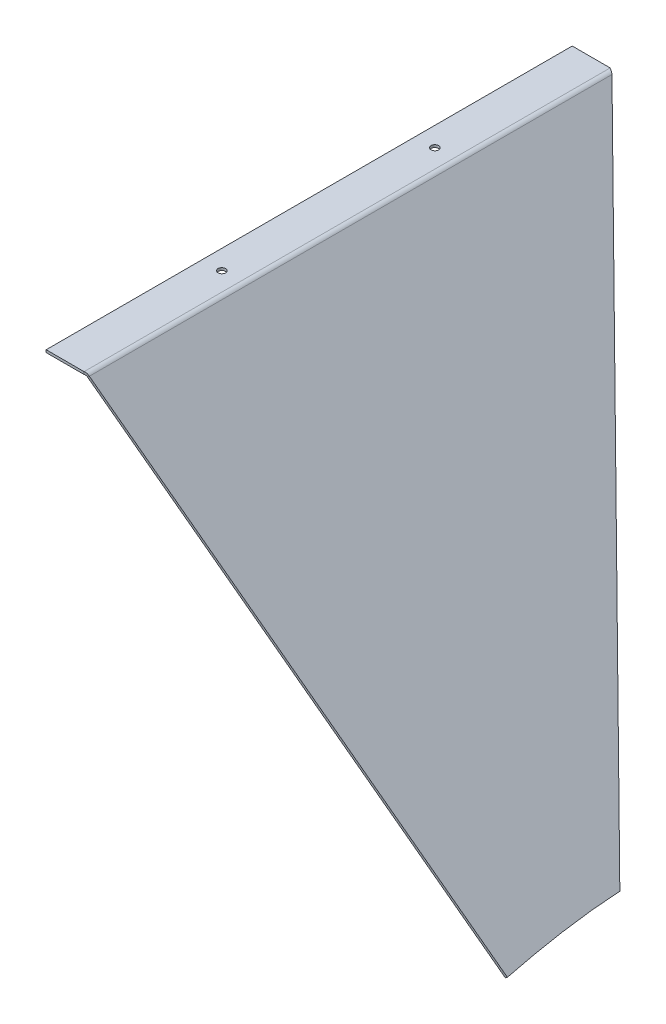
ISO-10303-21;
HEADER;
FILE_DESCRIPTION(('STEP AP214'),'2;1');
FILE_NAME('part.step','',(''),(''),'','','');
FILE_SCHEMA(('AUTOMOTIVE_DESIGN { 1 0 10303 214 1 1 1 1 }'));
ENDSEC;
DATA;
#1=APPLICATION_CONTEXT('core data for automotive mechanical design processes');
#2=APPLICATION_PROTOCOL_DEFINITION('international standard','automotive_design',2000,#1);
#3=PRODUCT_CONTEXT('',#1,'mechanical');
#4=PRODUCT('Part','Part','',(#3));
#5=PRODUCT_RELATED_PRODUCT_CATEGORY('part','',(#4));
#6=PRODUCT_DEFINITION_FORMATION('','',#4);
#7=PRODUCT_DEFINITION_CONTEXT('part definition',#1,'design');
#8=PRODUCT_DEFINITION('design','',#6,#7);
#9=PRODUCT_DEFINITION_SHAPE('','',#8);
#10=(LENGTH_UNIT() NAMED_UNIT(*) SI_UNIT(.MILLI.,.METRE.));
#11=(NAMED_UNIT(*) PLANE_ANGLE_UNIT() SI_UNIT($,.RADIAN.));
#12=(NAMED_UNIT(*) SI_UNIT($,.STERADIAN.) SOLID_ANGLE_UNIT());
#13=UNCERTAINTY_MEASURE_WITH_UNIT(LENGTH_MEASURE(1.E-05),#10,'distance_accuracy_value','');
#14=(GEOMETRIC_REPRESENTATION_CONTEXT(3) GLOBAL_UNCERTAINTY_ASSIGNED_CONTEXT((#13)) GLOBAL_UNIT_ASSIGNED_CONTEXT((#10,
#11,#12)) REPRESENTATION_CONTEXT('',''));
#15=CARTESIAN_POINT('',(0.,0.,0.));
#16=DIRECTION('',(0.,0.,1.));
#17=DIRECTION('',(1.,0.,0.));
#18=AXIS2_PLACEMENT_3D('',#15,#16,#17);
#19=CARTESIAN_POINT('',(-212.983750394162,3.33066907387547E-13,-210.16475123244));
#20=DIRECTION('',(0.,0.,-1.));
#21=DIRECTION('',(1.,0.,0.));
#22=AXIS2_PLACEMENT_3D('',#19,#20,#21);
#23=PLANE('',#22);
#24=DIRECTION('',(0.,1.,0.));
#25=VECTOR('',#24,1.);
#26=CARTESIAN_POINT('',(-212.983750394162,3.33066907387547E-13,-210.16475123244));
#27=LINE('',#26,#25);
#28=CARTESIAN_POINT('',(-212.983750394162,-2.00000000000103,-210.16475123244));
#29=VERTEX_POINT('',#28);
#30=CARTESIAN_POINT('',(-212.983750394162,3.33066907387547E-13,-210.16475123244));
#31=VERTEX_POINT('',#30);
#32=EDGE_CURVE('E11',#29,#31,#27,.T.);
#33=ORIENTED_EDGE('',*,*,#32,.F.);
#34=DIRECTION('',(1.,0.,0.));
#35=VECTOR('',#34,1.);
#36=CARTESIAN_POINT('',(200.024756253983,-2.00000000000101,-210.16475123244));
#37=LINE('',#36,#35);
#38=CARTESIAN_POINT('',(-242.983750394162,-2.00000000000103,-210.16475123244));
#39=VERTEX_POINT('',#38);
#40=EDGE_CURVE('E142',#39,#29,#37,.T.);
#41=ORIENTED_EDGE('',*,*,#40,.F.);
#42=DIRECTION('',(0.,1.,0.));
#43=VECTOR('',#42,1.);
#44=CARTESIAN_POINT('',(-242.983750394162,4.44089209850063E-13,-210.16475123244));
#45=LINE('',#44,#43);
#46=CARTESIAN_POINT('',(-242.983750394162,4.44089209850063E-13,-210.16475123244));
#47=VERTEX_POINT('',#46);
#48=EDGE_CURVE('E55',#39,#47,#45,.T.);
#49=ORIENTED_EDGE('',*,*,#48,.T.);
#50=DIRECTION('',(1.,0.,0.));
#51=VECTOR('',#50,1.);
#52=CARTESIAN_POINT('',(-212.983750394162,3.33066907387547E-13,-210.16475123244));
#53=LINE('',#52,#51);
#54=EDGE_CURVE('E292',#47,#31,#53,.T.);
#55=ORIENTED_EDGE('',*,*,#54,.T.);
#56=EDGE_LOOP('',(#33,#41,#49,#55));
#57=FACE_BOUND('',#56,.T.);
#58=ADVANCED_FACE('F43',(#57),#23,.T.);
#59=CARTESIAN_POINT('',(-242.983750394162,4.44089209850063E-13,-210.16475123244));
#60=DIRECTION('',(-1.,0.,0.));
#61=DIRECTION('',(0.,0.,-1.));
#62=AXIS2_PLACEMENT_3D('',#59,#60,#61);
#63=PLANE('',#62);
#64=ORIENTED_EDGE('',*,*,#48,.F.);
#65=DIRECTION('',(0.,0.,1.));
#66=VECTOR('',#65,1.);
#67=CARTESIAN_POINT('',(-242.983750394162,-2.00000000000102,105.521367319601));
#68=LINE('',#67,#66);
#69=CARTESIAN_POINT('',(-242.983750394162,-2.00000000000102,209.716839146918));
#70=VERTEX_POINT('',#69);
#71=EDGE_CURVE('E646',#70,#39,#68,.F.);
#72=ORIENTED_EDGE('',*,*,#71,.F.);
#73=DIRECTION('',(0.,1.,0.));
#74=VECTOR('',#73,1.);
#75=CARTESIAN_POINT('',(-242.983750394162,4.44089209850063E-13,209.716839146918));
#76=LINE('',#75,#74);
#77=CARTESIAN_POINT('',(-242.983750394162,4.44089209850063E-13,209.716839146918));
#78=VERTEX_POINT('',#77);
#79=EDGE_CURVE('E642',#70,#78,#76,.T.);
#80=ORIENTED_EDGE('',*,*,#79,.T.);
#81=DIRECTION('',(0.,0.,-1.));
#82=VECTOR('',#81,1.);
#83=CARTESIAN_POINT('',(-242.983750394162,4.44089209850063E-13,-210.16475123244));
#84=LINE('',#83,#82);
#85=EDGE_CURVE('E297',#78,#47,#84,.T.);
#86=ORIENTED_EDGE('',*,*,#85,.T.);
#87=EDGE_LOOP('',(#64,#72,#80,#86));
#88=FACE_BOUND('',#87,.T.);
#89=ADVANCED_FACE('F337',(#88),#63,.T.);
#90=CARTESIAN_POINT('',(-212.983750394162,4.44089209850063E-13,209.716839146918));
#91=DIRECTION('',(0.,0.,1.));
#92=DIRECTION('',(-1.,0.,0.));
#93=AXIS2_PLACEMENT_3D('',#90,#91,#92);
#94=PLANE('',#93);
#95=ORIENTED_EDGE('',*,*,#79,.F.);
#96=DIRECTION('',(1.,0.,0.));
#97=VECTOR('',#96,1.);
#98=CARTESIAN_POINT('',(200.024756253983,-2.000000000001,209.716839146918));
#99=LINE('',#98,#97);
#100=CARTESIAN_POINT('',(-212.983750394162,-2.00000000000102,209.716839146918));
#101=VERTEX_POINT('',#100);
#102=EDGE_CURVE('E375',#101,#70,#99,.F.);
#103=ORIENTED_EDGE('',*,*,#102,.F.);
#104=DIRECTION('',(0.,1.,0.));
#105=VECTOR('',#104,1.);
#106=CARTESIAN_POINT('',(-212.983750394162,4.44089209850063E-13,209.716839146918));
#107=LINE('',#106,#105);
#108=CARTESIAN_POINT('',(-212.983750394162,4.44089209850063E-13,209.716839146918));
#109=VERTEX_POINT('',#108);
#110=EDGE_CURVE('E422',#101,#109,#107,.T.);
#111=ORIENTED_EDGE('',*,*,#110,.T.);
#112=DIRECTION('',(-1.,0.,0.));
#113=VECTOR('',#112,1.);
#114=CARTESIAN_POINT('',(-212.983750394162,4.44089209850063E-13,209.716839146918));
#115=LINE('',#114,#113);
#116=EDGE_CURVE('E301',#109,#78,#115,.T.);
#117=ORIENTED_EDGE('',*,*,#116,.T.);
#118=EDGE_LOOP('',(#95,#103,#111,#117));
#119=FACE_BOUND('',#118,.T.);
#120=ADVANCED_FACE('F343',(#119),#94,.T.);
#121=CARTESIAN_POINT('',(-212.983750394162,4.44089209850063E-13,209.716839146918));
#122=DIRECTION('',(0.173873809013477,0.,0.984767941465981));
#123=DIRECTION('',(-0.98476794146598,0.,0.173873809013477));
#124=AXIS2_PLACEMENT_3D('',#121,#122,#123);
#125=PLANE('',#124);
#126=ORIENTED_EDGE('',*,*,#110,.F.);
#127=DIRECTION('',(-0.98476794146598,0.,0.173873809013477));
#128=VECTOR('',#127,1.);
#129=CARTESIAN_POINT('',(-212.983750394162,-1.99999999999956,209.716839146918));
#130=LINE('',#129,#128);
#131=CARTESIAN_POINT('',(-212.694087450412,-2.00000000000102,209.665695321821));
#132=VERTEX_POINT('',#131);
#133=EDGE_CURVE('E138',#132,#101,#130,.T.);
#134=ORIENTED_EDGE('',*,*,#133,.F.);
#135=CARTESIAN_POINT('',(-212.694087450413,-8.30065183254902E-13,209.665695321821));
#136=CARTESIAN_POINT('',(-212.694087450413,-2.00000000000083,209.665695321821));
#137=B_SPLINE_CURVE_WITH_KNOTS('',1,(#135,#136),.UNSPECIFIED.,.F.,.F.,(2,2),(0.,1.),.UNSPECIFIED.);
#138=CARTESIAN_POINT('',(-212.694087450412,4.44089209850063E-13,209.665695321821));
#139=VERTEX_POINT('',#138);
#140=EDGE_CURVE('E257',#132,#139,#137,.F.);
#141=ORIENTED_EDGE('',*,*,#140,.T.);
#142=DIRECTION('',(-0.98476794146598,0.,0.173873809013477));
#143=VECTOR('',#142,1.);
#144=CARTESIAN_POINT('',(-212.983750394162,4.44089209850063E-13,209.716839146918));
#145=LINE('',#144,#143);
#146=EDGE_CURVE('E272',#139,#109,#145,.T.);
#147=ORIENTED_EDGE('',*,*,#146,.T.);
#148=EDGE_LOOP('',(#126,#134,#141,#147));
#149=FACE_BOUND('',#148,.T.);
#150=ADVANCED_FACE('F225',(#149),#125,.T.);
#151=CARTESIAN_POINT('',(-209.119216027711,-1.70512620117162,209.099911779111));
#152=CARTESIAN_POINT('',(-209.548804236997,-1.17462894304268,209.194236490375));
#153=CARTESIAN_POINT('',(-210.097790781909,-0.741898683723455,209.288506293348));
#154=CARTESIAN_POINT('',(-211.32968202828,-0.154316700259513,209.477100807584));
#155=CARTESIAN_POINT('',(-212.011465028835,-8.30067048991432E-13,209.571370610557));
#156=CARTESIAN_POINT('',(-212.694087450413,-8.30065183254902E-13,209.665695321821));
#157=CARTESIAN_POINT('',(-210.673507950624,-2.96376698327128,209.099911779111));
#158=CARTESIAN_POINT('',(-210.916315965262,-2.66392405641098,209.194235436708));
#159=CARTESIAN_POINT('',(-211.226615420389,-2.41933403862666,209.288506293348));
#160=CARTESIAN_POINT('',(-211.922901777033,-2.08722248275574,209.477100807584));
#161=CARTESIAN_POINT('',(-212.30826169601,-2.00000000000083,209.571371664224));
#162=CARTESIAN_POINT('',(-212.694087450413,-2.00000000000083,209.665695321821));
#163=B_SPLINE_SURFACE_WITH_KNOTS('',1,3,((#151,#152,#153,#154,#155,#156),(#157,#158,#159,#160,
#161,#162)),.UNSPECIFIED.,.F.,.F.,.F.,(2,2),(4,2,4),(0.,1.),(0.,0.5,1.),.UNSPECIFIED.);
#164=CARTESIAN_POINT('',(-212.694087450413,-2.00000000000083,209.665695321821));
#165=CARTESIAN_POINT('',(-212.30826169601,-2.00000000000083,209.571371664224));
#166=CARTESIAN_POINT('',(-211.922901777033,-2.08722248275574,209.477100807584));
#167=CARTESIAN_POINT('',(-211.226615420389,-2.41933403862666,209.288506293348));
#168=CARTESIAN_POINT('',(-210.916315965262,-2.66392405641098,209.194235436708));
#169=CARTESIAN_POINT('',(-210.673507950624,-2.96376698327128,209.099911779111));
#170=B_SPLINE_CURVE_WITH_KNOTS('',3,(#164,#165,#166,#167,#168,#169),.UNSPECIFIED.,.F.,.F.,(4,2,
4),(0.,0.5,1.),.UNSPECIFIED.);
#171=CARTESIAN_POINT('',(-210.673507950625,-2.96376698327128,209.099911779111));
#172=VERTEX_POINT('',#171);
#173=EDGE_CURVE('E132',#172,#132,#170,.F.);
#174=CARTESIAN_POINT('',(-210.673507950624,-2.96376698327128,209.099911779111));
#175=CARTESIAN_POINT('',(-209.119216027711,-1.70512620117162,209.099911779111));
#176=B_SPLINE_CURVE_WITH_KNOTS('',1,(#174,#175),.UNSPECIFIED.,.F.,.F.,(2,2),(0.,1.),.UNSPECIFIED.);
#177=CARTESIAN_POINT('',(-209.11921602771,-1.70512620117114,209.099911779111));
#178=VERTEX_POINT('',#177);
#179=EDGE_CURVE('E201',#172,#178,#176,.T.);
#180=CARTESIAN_POINT('',(-209.119216027711,-1.70512620117162,209.099911779111));
#181=CARTESIAN_POINT('',(-209.548804236997,-1.17462894304268,209.194236490375));
#182=CARTESIAN_POINT('',(-210.097790781909,-0.741898683723455,209.288506293348));
#183=CARTESIAN_POINT('',(-211.32968202828,-0.154316700259513,209.477100807584));
#184=CARTESIAN_POINT('',(-212.011465028835,-8.30067048991432E-13,209.571370610557));
#185=CARTESIAN_POINT('',(-212.694087450413,-8.30065183254902E-13,209.665695321821));
#186=B_SPLINE_CURVE_WITH_KNOTS('',3,(#180,#181,#182,#183,#184,#185),.UNSPECIFIED.,.F.,.F.,(4,2,
4),(0.,0.5,1.),.UNSPECIFIED.);
#187=EDGE_CURVE('E120',#178,#139,#186,.T.);
#188=ORIENTED_EDGE('',*,*,#140,.F.);
#189=ORIENTED_EDGE('',*,*,#173,.F.);
#190=ORIENTED_EDGE('',*,*,#179,.T.);
#191=ORIENTED_EDGE('',*,*,#187,.T.);
#192=EDGE_LOOP('',(#188,#189,#190,#191));
#193=FACE_BOUND('',#192,.T.);
#194=ADVANCED_FACE('F212',(#193),#163,.F.);
#195=CARTESIAN_POINT('',(-211.318116508365,1.01028974989403,209.716839146918));
#196=DIRECTION('',(0.109422333481686,-0.135125328477965,0.984767941465981));
#197=DIRECTION('',(-0.61973454601671,0.765308428682585,0.173873809013477));
#198=AXIS2_PLACEMENT_3D('',#195,#196,#197);
#199=PLANE('',#198);
#200=ORIENTED_EDGE('',*,*,#179,.F.);
#201=DIRECTION('',(-0.61973454601671,0.765308428682585,0.173873809013477));
#202=VECTOR('',#201,1.);
#203=CARTESIAN_POINT('',(-212.872408431279,-0.248351032205649,209.716839146918));
#204=LINE('',#203,#202);
#205=CARTESIAN_POINT('',(49.8711120542214,-324.709577377762,136.001057133384));
#206=VERTEX_POINT('',#205);
#207=EDGE_CURVE('E374',#206,#172,#204,.T.);
#208=ORIENTED_EDGE('',*,*,#207,.F.);
#209=DIRECTION('',(0.777145961456972,0.629320391049836,0.));
#210=VECTOR('',#209,1.);
#211=CARTESIAN_POINT('',(51.4254039771354,-323.450936595663,136.001057133384));
#212=LINE('',#211,#210);
#213=CARTESIAN_POINT('',(51.4254039771354,-323.450936595663,136.001057133384));
#214=VERTEX_POINT('',#213);
#215=EDGE_CURVE('E198',#206,#214,#212,.T.);
#216=ORIENTED_EDGE('',*,*,#215,.T.);
#217=DIRECTION('',(-0.61973454601671,0.765308428682585,0.173873809013477));
#218=VECTOR('',#217,1.);
#219=CARTESIAN_POINT('',(-211.318116508365,1.01028974989403,209.716839146918));
#220=LINE('',#219,#218);
#221=EDGE_CURVE('E309',#214,#178,#220,.T.);
#222=ORIENTED_EDGE('',*,*,#221,.T.);
#223=EDGE_LOOP('',(#200,#208,#216,#222));
#224=FACE_BOUND('',#223,.T.);
#225=ADVANCED_FACE('F224',(#224),#199,.T.);
#226=CARTESIAN_POINT('',(44.8159523652646,-315.288943593907,35.9112998267714));
#227=CARTESIAN_POINT('',(45.5254815552095,-316.165139173049,76.932008688372));
#228=CARTESIAN_POINT('',(49.9041243624014,-321.572312725133,129.596807563132));
#229=CARTESIAN_POINT('',(57.4760581931329,-330.922872282175,188.182667124129));
#230=(BOUNDED_CURVE() B_SPLINE_CURVE(3,(#226,#227,#228,#229),.UNSPECIFIED.,.F.,
.F.) B_SPLINE_CURVE_WITH_KNOTS((4,4),(0.,1.),
.UNSPECIFIED.) CURVE() GEOMETRIC_REPRESENTATION_ITEM() RATIONAL_B_SPLINE_CURVE((1.,
0.963777010772526,0.963777010772526,1.)) REPRESENTATION_ITEM(''));
#231=DIRECTION('',(-0.777145961456972,-0.629320391049836,0.));
#232=VECTOR('',#231,1.);
#233=SURFACE_OF_LINEAR_EXTRUSION('',#230,#232);
#234=ORIENTED_EDGE('',*,*,#215,.F.);
#235=CARTESIAN_POINT('',(43.2616604423507,-316.547584376007,35.9112998267714));
#236=CARTESIAN_POINT('',(43.9711896322956,-317.423779955149,76.932008688372));
#237=CARTESIAN_POINT('',(48.3498324394875,-322.830953507232,129.596807563132));
#238=CARTESIAN_POINT('',(55.9217662702189,-332.181513064274,188.182667124129));
#239=(BOUNDED_CURVE() B_SPLINE_CURVE(3,(#235,#236,#237,#238),.UNSPECIFIED.,.F.,
.F.) B_SPLINE_CURVE_WITH_KNOTS((4,4),(0.,1.),
.UNSPECIFIED.) CURVE() GEOMETRIC_REPRESENTATION_ITEM() RATIONAL_B_SPLINE_CURVE((1.,
0.963777010772526,0.963777010772526,1.)) REPRESENTATION_ITEM(''));
#240=CARTESIAN_POINT('',(43.3373713851553,-316.641079603995,39.7071694117073));
#241=VERTEX_POINT('',#240);
#242=EDGE_CURVE('E381',#241,#206,#239,.T.);
#243=ORIENTED_EDGE('',*,*,#242,.F.);
#244=DIRECTION('',(0.777145961456972,0.629320391049836,0.));
#245=VECTOR('',#244,1.);
#246=CARTESIAN_POINT('',(44.8916633080693,-315.382438821895,39.7071694117073));
#247=LINE('',#246,#245);
#248=CARTESIAN_POINT('',(44.8916633080693,-315.382438821895,39.7071694117073));
#249=VERTEX_POINT('',#248);
#250=EDGE_CURVE('E191',#241,#249,#247,.T.);
#251=ORIENTED_EDGE('',*,*,#250,.T.);
#252=EDGE_CURVE('E314',#249,#214,#230,.T.);
#253=ORIENTED_EDGE('',*,*,#252,.T.);
#254=EDGE_LOOP('',(#234,#243,#251,#253));
#255=FACE_BOUND('',#254,.T.);
#256=ADVANCED_FACE('F328',(#255),#233,.T.);
#257=CARTESIAN_POINT('',(44.8916633080693,-315.382438821895,39.7071694117073));
#258=DIRECTION('',(0.32919017698519,-0.406516013518283,-0.852278451053212));
#259=DIRECTION('',(0.536356208100153,-0.662344756272809,0.523088369083406));
#260=AXIS2_PLACEMENT_3D('',#257,#258,#259);
#261=PLANE('',#260);
#262=ORIENTED_EDGE('',*,*,#250,.F.);
#263=DIRECTION('',(0.536356208100153,-0.662344756272809,0.523088369083406));
#264=VECTOR('',#263,1.);
#265=CARTESIAN_POINT('',(43.3373713851553,-316.641079603995,39.7071694117073));
#266=LINE('',#265,#264);
#267=CARTESIAN_POINT('',(-210.673507950624,-2.96376698327127,-208.020244934513));
#268=VERTEX_POINT('',#267);
#269=EDGE_CURVE('E150',#268,#241,#266,.T.);
#270=ORIENTED_EDGE('',*,*,#269,.F.);
#271=CARTESIAN_POINT('',(-209.119216027711,-1.70512620117162,-208.020244934513));
#272=CARTESIAN_POINT('',(-210.673507950624,-2.96376698327128,-208.020244934513));
#273=B_SPLINE_CURVE_WITH_KNOTS('',1,(#271,#272),.UNSPECIFIED.,.F.,.F.,(2,2),(0.,1.),.UNSPECIFIED.);
#274=CARTESIAN_POINT('',(-209.11921602771,-1.70512620117114,-208.020244934513));
#275=VERTEX_POINT('',#274);
#276=EDGE_CURVE('E64',#268,#275,#273,.F.);
#277=ORIENTED_EDGE('',*,*,#276,.T.);
#278=DIRECTION('',(0.536356208100153,-0.662344756272809,0.523088369083406));
#279=VECTOR('',#278,1.);
#280=CARTESIAN_POINT('',(44.8916633080693,-315.382438821895,39.7071694117073));
#281=LINE('',#280,#279);
#282=EDGE_CURVE('E323',#275,#249,#281,.T.);
#283=ORIENTED_EDGE('',*,*,#282,.T.);
#284=EDGE_LOOP('',(#262,#270,#277,#283));
#285=FACE_BOUND('',#284,.T.);
#286=ADVANCED_FACE('F174',(#285),#261,.T.);
#287=CARTESIAN_POINT('',(-212.694087450413,-8.37871438896798E-13,-209.986969761322));
#288=CARTESIAN_POINT('',(-212.011499192579,-8.37864953719286E-13,-209.659103266421));
#289=CARTESIAN_POINT('',(-211.32968202828,-0.154316700259519,-209.331394819052));
#290=CARTESIAN_POINT('',(-210.097790781909,-0.741898683723459,-208.675819876783));
#291=CARTESIAN_POINT('',(-209.548782737056,-1.17465549325855,-208.348111429415));
#292=CARTESIAN_POINT('',(-209.119216027711,-1.70512620117162,-208.020244934513));
#293=CARTESIAN_POINT('',(-212.694087450413,-2.00000000000084,-209.986969761322));
#294=CARTESIAN_POINT('',(-212.308303232797,-2.00000000000084,-209.659125817714));
#295=CARTESIAN_POINT('',(-211.922901777033,-2.08722248275574,-209.331394819052));
#296=CARTESIAN_POINT('',(-211.226615420389,-2.41933403862667,-208.675819876783));
#297=CARTESIAN_POINT('',(-210.916289825315,-2.66395633655722,-208.348088878122));
#298=CARTESIAN_POINT('',(-210.673507950624,-2.96376698327128,-208.020244934513));
#299=B_SPLINE_SURFACE_WITH_KNOTS('',1,3,((#287,#288,#289,#290,#291,#292),(#293,#294,#295,#296,
#297,#298)),.UNSPECIFIED.,.F.,.F.,.F.,(2,2),(4,2,4),(0.,1.),(0.,0.5,1.),.UNSPECIFIED.);
#300=CARTESIAN_POINT('',(-210.673507950624,-2.96376698327128,-208.020244934513));
#301=CARTESIAN_POINT('',(-210.916289825315,-2.66395633655722,-208.348088878122));
#302=CARTESIAN_POINT('',(-211.226615420389,-2.41933403862667,-208.675819876783));
#303=CARTESIAN_POINT('',(-211.922901777033,-2.08722248275574,-209.331394819052));
#304=CARTESIAN_POINT('',(-212.308303232797,-2.00000000000084,-209.659125817714));
#305=CARTESIAN_POINT('',(-212.694087450413,-2.00000000000084,-209.986969761322));
#306=B_SPLINE_CURVE_WITH_KNOTS('',3,(#300,#301,#302,#303,#304,#305),.UNSPECIFIED.,.F.,.F.,(4,2,
4),(0.,0.5,1.),.UNSPECIFIED.);
#307=CARTESIAN_POINT('',(-212.694087450412,-2.00000000000103,-209.986969761322));
#308=VERTEX_POINT('',#307);
#309=EDGE_CURVE('E129',#308,#268,#306,.F.);
#310=CARTESIAN_POINT('',(-212.694087450413,-2.00000000000084,-209.986969761322));
#311=CARTESIAN_POINT('',(-212.694087450413,-8.37871438896798E-13,-209.986969761322));
#312=B_SPLINE_CURVE_WITH_KNOTS('',1,(#310,#311),.UNSPECIFIED.,.F.,.F.,(2,2),(0.,1.),.UNSPECIFIED.);
#313=CARTESIAN_POINT('',(-212.694087450412,4.44089209850063E-13,-209.986969761322));
#314=VERTEX_POINT('',#313);
#315=EDGE_CURVE('E106',#308,#314,#312,.T.);
#316=CARTESIAN_POINT('',(-212.694087450413,-8.37871438896798E-13,-209.986969761322));
#317=CARTESIAN_POINT('',(-212.011499192579,-8.37864953719286E-13,-209.659103266421));
#318=CARTESIAN_POINT('',(-211.32968202828,-0.154316700259519,-209.331394819052));
#319=CARTESIAN_POINT('',(-210.097790781909,-0.741898683723459,-208.675819876783));
#320=CARTESIAN_POINT('',(-209.548782737056,-1.17465549325855,-208.348111429415));
#321=CARTESIAN_POINT('',(-209.119216027711,-1.70512620117162,-208.020244934513));
#322=B_SPLINE_CURVE_WITH_KNOTS('',3,(#316,#317,#318,#319,#320,#321),.UNSPECIFIED.,.F.,.F.,(4,2,
4),(0.,0.5,1.),.UNSPECIFIED.);
#323=EDGE_CURVE('E394',#314,#275,#322,.T.);
#324=ORIENTED_EDGE('',*,*,#276,.F.);
#325=ORIENTED_EDGE('',*,*,#309,.F.);
#326=ORIENTED_EDGE('',*,*,#315,.T.);
#327=ORIENTED_EDGE('',*,*,#323,.T.);
#328=EDGE_LOOP('',(#324,#325,#326,#327));
#329=FACE_BOUND('',#328,.T.);
#330=ADVANCED_FACE('F146',(#329),#299,.F.);
#331=CARTESIAN_POINT('',(-227.5,0.,-85.));
#332=DIRECTION('',(0.,-1.,0.));
#333=DIRECTION('',(1.,0.,0.));
#334=AXIS2_PLACEMENT_3D('',#331,#332,#333);
#335=CYLINDRICAL_SURFACE('',#334,2.99999999999999);
#336=CARTESIAN_POINT('',(-227.5,0.,-85.));
#337=DIRECTION('',(0.,1.,0.));
#338=DIRECTION('',(0.,0.,1.));
#339=AXIS2_PLACEMENT_3D('',#336,#337,#338);
#340=CIRCLE('',#339,2.99999999999999);
#341=CARTESIAN_POINT('',(-227.5,0.,-82.));
#342=VERTEX_POINT('',#341);
#343=EDGE_CURVE('E260',#342,#342,#340,.T.);
#344=ORIENTED_EDGE('',*,*,#343,.T.);
#345=EDGE_LOOP('',(#344));
#346=FACE_BOUND('',#345,.T.);
#347=CARTESIAN_POINT('',(-227.5,-2.,-85.));
#348=DIRECTION('',(0.,1.,0.));
#349=DIRECTION('',(0.,0.,1.));
#350=AXIS2_PLACEMENT_3D('',#347,#348,#349);
#351=CIRCLE('',#350,2.99999999999999);
#352=CARTESIAN_POINT('',(-227.5,-2.,-82.));
#353=VERTEX_POINT('',#352);
#354=EDGE_CURVE('E357',#353,#353,#351,.T.);
#355=ORIENTED_EDGE('',*,*,#354,.F.);
#356=EDGE_LOOP('',(#355));
#357=FACE_BOUND('',#356,.T.);
#358=ADVANCED_FACE('F173',(#346,#357),#335,.F.);
#359=CARTESIAN_POINT('',(-227.5,0.,85.));
#360=DIRECTION('',(0.,-1.,0.));
#361=DIRECTION('',(1.,0.,0.));
#362=AXIS2_PLACEMENT_3D('',#359,#360,#361);
#363=CYLINDRICAL_SURFACE('',#362,2.99999999999999);
#364=CARTESIAN_POINT('',(-227.5,0.,85.));
#365=DIRECTION('',(0.,1.,0.));
#366=DIRECTION('',(0.,0.,1.));
#367=AXIS2_PLACEMENT_3D('',#364,#365,#366);
#368=CIRCLE('',#367,2.99999999999999);
#369=CARTESIAN_POINT('',(-227.5,0.,88.));
#370=VERTEX_POINT('',#369);
#371=EDGE_CURVE('E265',#370,#370,#368,.T.);
#372=ORIENTED_EDGE('',*,*,#371,.T.);
#373=EDGE_LOOP('',(#372));
#374=FACE_BOUND('',#373,.T.);
#375=CARTESIAN_POINT('',(-227.5,-2.,85.));
#376=DIRECTION('',(0.,1.,0.));
#377=DIRECTION('',(0.,0.,1.));
#378=AXIS2_PLACEMENT_3D('',#375,#376,#377);
#379=CIRCLE('',#378,2.99999999999999);
#380=CARTESIAN_POINT('',(-227.5,-2.,88.));
#381=VERTEX_POINT('',#380);
#382=EDGE_CURVE('E360',#381,#381,#379,.T.);
#383=ORIENTED_EDGE('',*,*,#382,.F.);
#384=EDGE_LOOP('',(#383));
#385=FACE_BOUND('',#384,.T.);
#386=ADVANCED_FACE('F45',(#374,#385),#363,.F.);
#387=CARTESIAN_POINT('',(194.137619674627,-1.11022302462516E-12,39.7071694117073));
#388=DIRECTION('',(0.523088369083407,0.,-0.852278451053212));
#389=DIRECTION('',(0.852278451053212,0.,0.523088369083406));
#390=AXIS2_PLACEMENT_3D('',#387,#388,#389);
#391=PLANE('',#390);
#392=DIRECTION('',(0.852278451053212,0.,0.523088369083406));
#393=VECTOR('',#392,1.);
#394=CARTESIAN_POINT('',(194.137619674627,-2.00000000000111,39.7071694117073));
#395=LINE('',#394,#393);
#396=EDGE_CURVE('E110',#29,#308,#395,.T.);
#397=ORIENTED_EDGE('',*,*,#396,.F.);
#398=ORIENTED_EDGE('',*,*,#32,.T.);
#399=DIRECTION('',(0.852278451053212,0.,0.523088369083406));
#400=VECTOR('',#399,1.);
#401=CARTESIAN_POINT('',(194.137619674627,-1.11022302462516E-12,39.7071694117073));
#402=LINE('',#401,#400);
#403=EDGE_CURVE('E113',#31,#314,#402,.T.);
#404=ORIENTED_EDGE('',*,*,#403,.T.);
#405=ORIENTED_EDGE('',*,*,#315,.F.);
#406=EDGE_LOOP('',(#397,#398,#404,#405));
#407=FACE_BOUND('',#406,.T.);
#408=ADVANCED_FACE('F108',(#407),#391,.T.);
#409=CARTESIAN_POINT('',(-212.694087450413,-4.60000000000083,420.224435532473));
#410=DIRECTION('',(0.,0.,-1.));
#411=DIRECTION('',(0.,1.,0.));
#412=AXIS2_PLACEMENT_3D('',#409,#410,#411);
#413=CYLINDRICAL_SURFACE('',#412,4.6);
#414=ORIENTED_EDGE('',*,*,#323,.F.);
#415=DIRECTION('',(0.,0.,-1.));
#416=VECTOR('',#415,1.);
#417=CARTESIAN_POINT('',(-212.694087450412,-1.11022302462516E-12,105.521367319601));
#418=LINE('',#417,#416);
#419=EDGE_CURVE('E283',#139,#314,#418,.T.);
#420=ORIENTED_EDGE('',*,*,#419,.F.);
#421=ORIENTED_EDGE('',*,*,#187,.F.);
#422=DIRECTION('',(0.,0.,-1.));
#423=VECTOR('',#422,1.);
#424=CARTESIAN_POINT('',(-209.119216027711,-1.70512620117158,105.521367319601));
#425=LINE('',#424,#423);
#426=EDGE_CURVE('E305',#178,#275,#425,.T.);
#427=ORIENTED_EDGE('',*,*,#426,.T.);
#428=EDGE_LOOP('',(#414,#420,#421,#427));
#429=FACE_BOUND('',#428,.T.);
#430=ADVANCED_FACE('F348',(#429),#413,.T.);
#431=CARTESIAN_POINT('',(48.5965584023535,-319.957603239088,105.521367319601));
#432=DIRECTION('',(-0.777145961456972,-0.629320391049836,0.));
#433=DIRECTION('',(0.629320391049836,-0.777145961456972,0.));
#434=AXIS2_PLACEMENT_3D('',#431,#432,#433);
#435=PLANE('',#434);
#436=ORIENTED_EDGE('',*,*,#426,.F.);
#437=ORIENTED_EDGE('',*,*,#221,.F.);
#438=ORIENTED_EDGE('',*,*,#252,.F.);
#439=ORIENTED_EDGE('',*,*,#282,.F.);
#440=EDGE_LOOP('',(#436,#437,#438,#439));
#441=FACE_BOUND('',#440,.T.);
#442=ADVANCED_FACE('F403',(#441),#435,.F.);
#443=CARTESIAN_POINT('',(200.024756253983,-9.99200722162641E-13,105.521367319601));
#444=DIRECTION('',(0.,-1.,0.));
#445=DIRECTION('',(1.,0.,0.));
#446=AXIS2_PLACEMENT_3D('',#443,#444,#445);
#447=PLANE('',#446);
#448=ORIENTED_EDGE('',*,*,#343,.F.);
#449=EDGE_LOOP('',(#448));
#450=FACE_BOUND('',#449,.T.);
#451=ORIENTED_EDGE('',*,*,#371,.F.);
#452=EDGE_LOOP('',(#451));
#453=FACE_BOUND('',#452,.T.);
#454=ORIENTED_EDGE('',*,*,#146,.F.);
#455=ORIENTED_EDGE('',*,*,#419,.T.);
#456=ORIENTED_EDGE('',*,*,#403,.F.);
#457=ORIENTED_EDGE('',*,*,#54,.F.);
#458=ORIENTED_EDGE('',*,*,#85,.F.);
#459=ORIENTED_EDGE('',*,*,#116,.F.);
#460=EDGE_LOOP('',(#454,#455,#456,#457,#458,#459));
#461=FACE_BOUND('',#460,.T.);
#462=ADVANCED_FACE('F426',(#450,#453,#461),#447,.F.);
#463=CARTESIAN_POINT('',(-212.694087450413,-4.60000000000083,420.224435532473));
#464=DIRECTION('',(0.,0.,-1.));
#465=DIRECTION('',(0.,1.,0.));
#466=AXIS2_PLACEMENT_3D('',#463,#464,#465);
#467=CYLINDRICAL_SURFACE('',#466,2.6);
#468=ORIENTED_EDGE('',*,*,#309,.T.);
#469=DIRECTION('',(0.,0.,-1.));
#470=VECTOR('',#469,1.);
#471=CARTESIAN_POINT('',(-210.673507950624,-2.96376698327125,420.224435532473));
#472=LINE('',#471,#470);
#473=EDGE_CURVE('E371',#172,#268,#472,.T.);
#474=ORIENTED_EDGE('',*,*,#473,.F.);
#475=ORIENTED_EDGE('',*,*,#173,.T.);
#476=DIRECTION('',(0.,0.,1.));
#477=VECTOR('',#476,1.);
#478=CARTESIAN_POINT('',(-212.694087450412,-2.00000000000102,105.521367319601));
#479=LINE('',#478,#477);
#480=EDGE_CURVE('E126',#132,#308,#479,.F.);
#481=ORIENTED_EDGE('',*,*,#480,.T.);
#482=EDGE_LOOP('',(#468,#474,#475,#481));
#483=FACE_BOUND('',#482,.T.);
#484=ADVANCED_FACE('F127',(#483),#467,.F.);
#485=CARTESIAN_POINT('',(47.0422664794395,-321.216244021187,105.521367319601));
#486=DIRECTION('',(-0.777145961456972,-0.629320391049836,0.));
#487=DIRECTION('',(0.629320391049836,-0.777145961456972,0.));
#488=AXIS2_PLACEMENT_3D('',#485,#486,#487);
#489=PLANE('',#488);
#490=ORIENTED_EDGE('',*,*,#473,.T.);
#491=ORIENTED_EDGE('',*,*,#269,.T.);
#492=ORIENTED_EDGE('',*,*,#242,.T.);
#493=ORIENTED_EDGE('',*,*,#207,.T.);
#494=EDGE_LOOP('',(#490,#491,#492,#493));
#495=FACE_BOUND('',#494,.T.);
#496=ADVANCED_FACE('F445',(#495),#489,.T.);
#497=CARTESIAN_POINT('',(200.024756253983,-2.000000000001,105.521367319601));
#498=DIRECTION('',(0.,-1.,0.));
#499=DIRECTION('',(1.,0.,0.));
#500=AXIS2_PLACEMENT_3D('',#497,#498,#499);
#501=PLANE('',#500);
#502=ORIENTED_EDGE('',*,*,#354,.T.);
#503=EDGE_LOOP('',(#502));
#504=FACE_BOUND('',#503,.T.);
#505=ORIENTED_EDGE('',*,*,#382,.T.);
#506=EDGE_LOOP('',(#505));
#507=FACE_BOUND('',#506,.T.);
#508=ORIENTED_EDGE('',*,*,#133,.T.);
#509=ORIENTED_EDGE('',*,*,#102,.T.);
#510=ORIENTED_EDGE('',*,*,#71,.T.);
#511=ORIENTED_EDGE('',*,*,#40,.T.);
#512=ORIENTED_EDGE('',*,*,#396,.T.);
#513=ORIENTED_EDGE('',*,*,#480,.F.);
#514=EDGE_LOOP('',(#508,#509,#510,#511,#512,#513));
#515=FACE_BOUND('',#514,.T.);
#516=ADVANCED_FACE('F140',(#504,#507,#515),#501,.T.);
#517=CLOSED_SHELL('',(#58,#89,#120,#150,#194,#225,#256,#286,#330,#358,#386,#408,#430,#442,#462,
#484,#496,#516));
#518=MANIFOLD_SOLID_BREP('B2',#517);
#519=ADVANCED_BREP_SHAPE_REPRESENTATION('',(#18,#518),#14);
#520=SHAPE_DEFINITION_REPRESENTATION(#9,#519);
ENDSEC;
END-ISO-10303-21;
